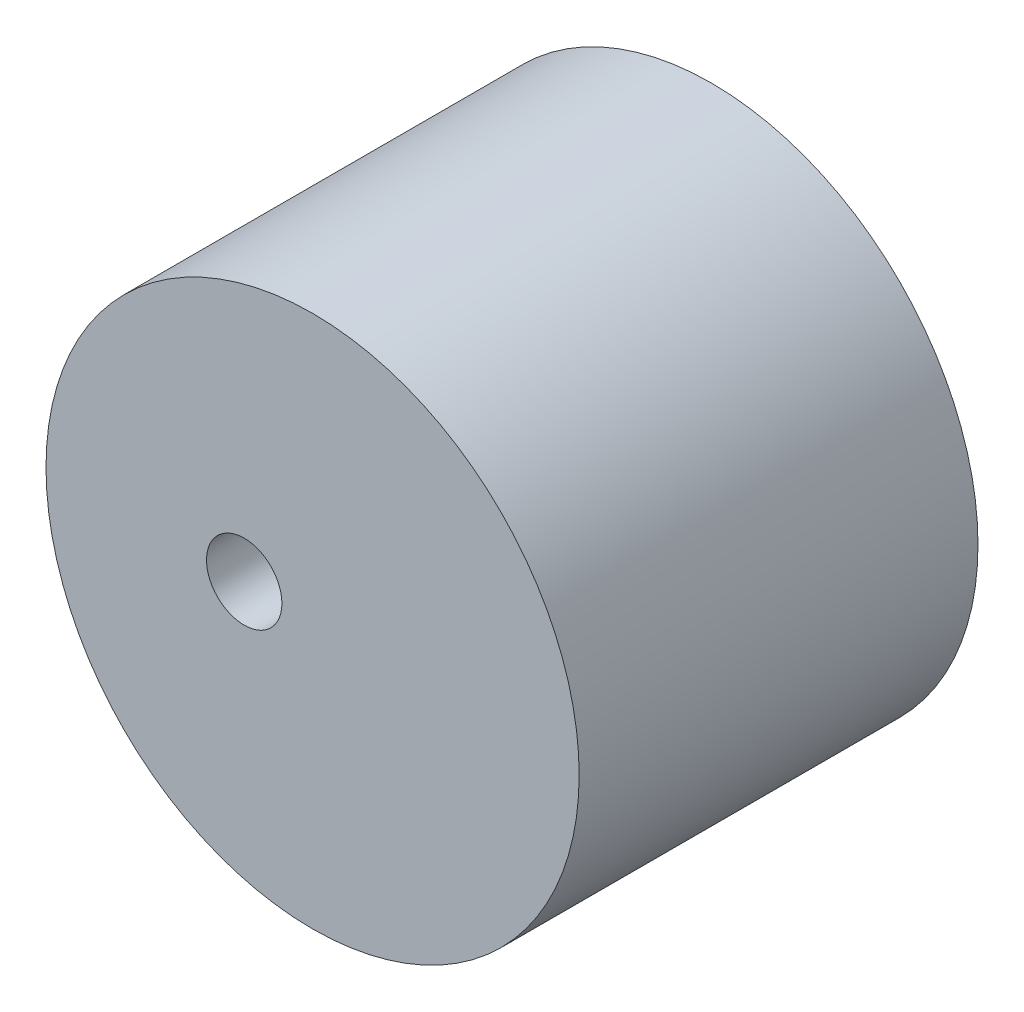
ISO-10303-21;
HEADER;
FILE_DESCRIPTION(('STEP AP214'),'2;1');
FILE_NAME('part.step','',(''),(''),'','','');
FILE_SCHEMA(('AUTOMOTIVE_DESIGN { 1 0 10303 214 1 1 1 1 }'));
ENDSEC;
DATA;
#1=APPLICATION_CONTEXT('core data for automotive mechanical design processes');
#2=APPLICATION_PROTOCOL_DEFINITION('international standard','automotive_design',2000,#1);
#3=PRODUCT_CONTEXT('',#1,'mechanical');
#4=PRODUCT('Part','Part','',(#3));
#5=PRODUCT_RELATED_PRODUCT_CATEGORY('part','',(#4));
#6=PRODUCT_DEFINITION_FORMATION('','',#4);
#7=PRODUCT_DEFINITION_CONTEXT('part definition',#1,'design');
#8=PRODUCT_DEFINITION('design','',#6,#7);
#9=PRODUCT_DEFINITION_SHAPE('','',#8);
#10=(LENGTH_UNIT() NAMED_UNIT(*) SI_UNIT(.MILLI.,.METRE.));
#11=(NAMED_UNIT(*) PLANE_ANGLE_UNIT() SI_UNIT($,.RADIAN.));
#12=(NAMED_UNIT(*) SI_UNIT($,.STERADIAN.) SOLID_ANGLE_UNIT());
#13=UNCERTAINTY_MEASURE_WITH_UNIT(LENGTH_MEASURE(1.E-05),#10,'distance_accuracy_value','');
#14=(GEOMETRIC_REPRESENTATION_CONTEXT(3) GLOBAL_UNCERTAINTY_ASSIGNED_CONTEXT((#13)) GLOBAL_UNIT_ASSIGNED_CONTEXT((#10,
#11,#12)) REPRESENTATION_CONTEXT('',''));
#15=CARTESIAN_POINT('',(0.,0.,0.));
#16=DIRECTION('',(0.,0.,1.));
#17=DIRECTION('',(1.,0.,0.));
#18=AXIS2_PLACEMENT_3D('',#15,#16,#17);
#19=CARTESIAN_POINT('',(0.,0.,35.));
#20=DIRECTION('',(0.,0.,1.));
#21=DIRECTION('',(1.,0.,0.));
#22=AXIS2_PLACEMENT_3D('',#19,#20,#21);
#23=PLANE('',#22);
#24=CARTESIAN_POINT('',(0.,0.,35.));
#25=DIRECTION('',(0.,0.,1.));
#26=DIRECTION('',(1.,0.,0.));
#27=AXIS2_PLACEMENT_3D('',#24,#25,#26);
#28=CIRCLE('',#27,23.39375);
#29=CARTESIAN_POINT('',(23.39375,0.,35.));
#30=VERTEX_POINT('',#29);
#31=EDGE_CURVE('E10',#30,#30,#28,.T.);
#32=ORIENTED_EDGE('',*,*,#31,.T.);
#33=EDGE_LOOP('',(#32));
#34=FACE_BOUND('',#33,.T.);
#35=CARTESIAN_POINT('',(-6.,0.,35.));
#36=DIRECTION('',(0.,0.,1.));
#37=DIRECTION('',(1.,0.,0.));
#38=AXIS2_PLACEMENT_3D('',#35,#36,#37);
#39=CIRCLE('',#38,3.3085);
#40=CARTESIAN_POINT('',(-2.6915,0.,35.));
#41=VERTEX_POINT('',#40);
#42=EDGE_CURVE('E50',#41,#41,#39,.T.);
#43=ORIENTED_EDGE('',*,*,#42,.F.);
#44=EDGE_LOOP('',(#43));
#45=FACE_BOUND('',#44,.T.);
#46=ADVANCED_FACE('F37',(#34,#45),#23,.T.);
#47=CARTESIAN_POINT('',(0.,0.,0.));
#48=DIRECTION('',(0.,0.,1.));
#49=DIRECTION('',(1.,0.,0.));
#50=AXIS2_PLACEMENT_3D('',#47,#48,#49);
#51=PLANE('',#50);
#52=CARTESIAN_POINT('',(0.,0.,0.));
#53=DIRECTION('',(0.,0.,1.));
#54=DIRECTION('',(1.,0.,0.));
#55=AXIS2_PLACEMENT_3D('',#52,#53,#54);
#56=CIRCLE('',#55,23.39375);
#57=CARTESIAN_POINT('',(23.39375,0.,0.));
#58=VERTEX_POINT('',#57);
#59=EDGE_CURVE('E41',#58,#58,#56,.T.);
#60=ORIENTED_EDGE('',*,*,#59,.F.);
#61=EDGE_LOOP('',(#60));
#62=FACE_BOUND('',#61,.T.);
#63=CARTESIAN_POINT('',(-6.,0.,0.));
#64=DIRECTION('',(0.,0.,1.));
#65=DIRECTION('',(1.,0.,0.));
#66=AXIS2_PLACEMENT_3D('',#63,#64,#65);
#67=CIRCLE('',#66,3.3085);
#68=CARTESIAN_POINT('',(-2.6915,0.,0.));
#69=VERTEX_POINT('',#68);
#70=EDGE_CURVE('E52',#69,#69,#67,.T.);
#71=ORIENTED_EDGE('',*,*,#70,.T.);
#72=EDGE_LOOP('',(#71));
#73=FACE_BOUND('',#72,.T.);
#74=ADVANCED_FACE('F64',(#62,#73),#51,.F.);
#75=CARTESIAN_POINT('',(0.,0.,35.));
#76=DIRECTION('',(0.,0.,-1.));
#77=DIRECTION('',(-1.,0.,0.));
#78=AXIS2_PLACEMENT_3D('',#75,#76,#77);
#79=CYLINDRICAL_SURFACE('',#78,23.39375);
#80=ORIENTED_EDGE('',*,*,#31,.F.);
#81=EDGE_LOOP('',(#80));
#82=FACE_BOUND('',#81,.T.);
#83=ORIENTED_EDGE('',*,*,#59,.T.);
#84=EDGE_LOOP('',(#83));
#85=FACE_BOUND('',#84,.T.);
#86=ADVANCED_FACE('F39',(#82,#85),#79,.T.);
#87=CARTESIAN_POINT('',(-6.,0.,35.));
#88=DIRECTION('',(0.,0.,-1.));
#89=DIRECTION('',(-1.,0.,0.));
#90=AXIS2_PLACEMENT_3D('',#87,#88,#89);
#91=CYLINDRICAL_SURFACE('',#90,3.3085);
#92=ORIENTED_EDGE('',*,*,#42,.T.);
#93=EDGE_LOOP('',(#92));
#94=FACE_BOUND('',#93,.T.);
#95=ORIENTED_EDGE('',*,*,#70,.F.);
#96=EDGE_LOOP('',(#95));
#97=FACE_BOUND('',#96,.T.);
#98=ADVANCED_FACE('F60',(#94,#97),#91,.F.);
#99=CLOSED_SHELL('',(#46,#74,#86,#98));
#100=MANIFOLD_SOLID_BREP('B2',#99);
#101=ADVANCED_BREP_SHAPE_REPRESENTATION('',(#18,#100),#14);
#102=SHAPE_DEFINITION_REPRESENTATION(#9,#101);
ENDSEC;
END-ISO-10303-21;
